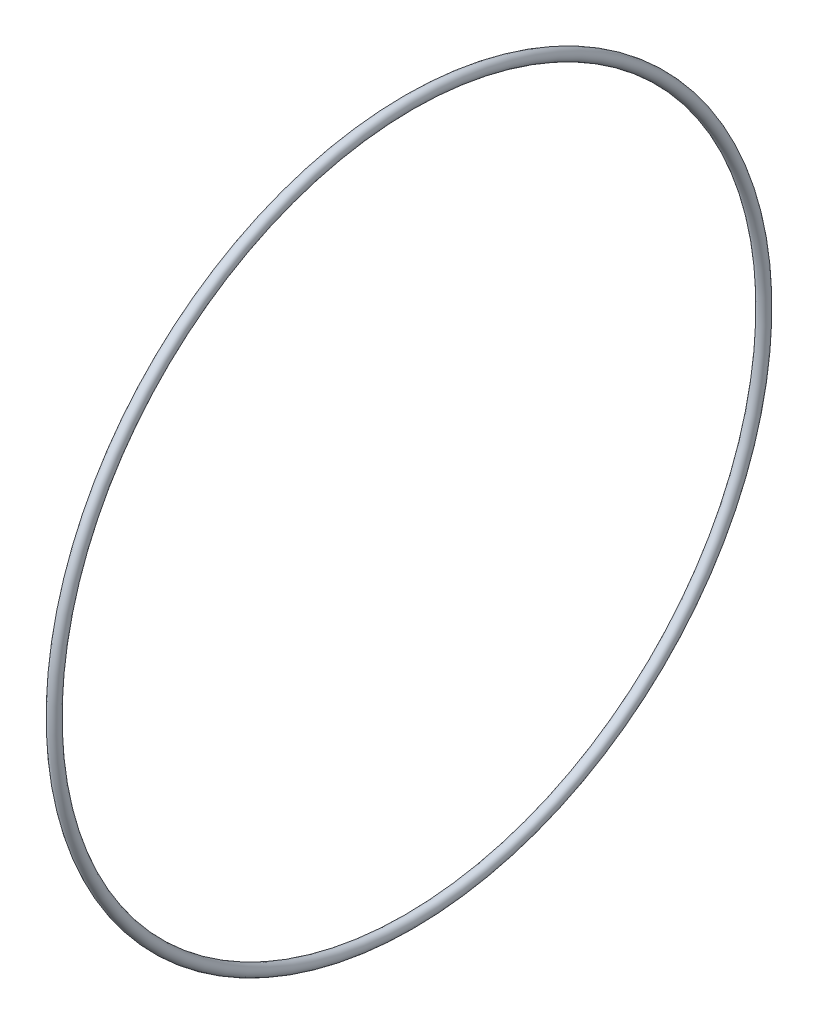
ISO-10303-21;
HEADER;
FILE_DESCRIPTION(('STEP AP214'),'2;1');
FILE_NAME('part.step','',(''),(''),'','','');
FILE_SCHEMA(('AUTOMOTIVE_DESIGN { 1 0 10303 214 1 1 1 1 }'));
ENDSEC;
DATA;
#1=APPLICATION_CONTEXT('core data for automotive mechanical design processes');
#2=APPLICATION_PROTOCOL_DEFINITION('international standard','automotive_design',2000,#1);
#3=PRODUCT_CONTEXT('',#1,'mechanical');
#4=PRODUCT('Part','Part','',(#3));
#5=PRODUCT_RELATED_PRODUCT_CATEGORY('part','',(#4));
#6=PRODUCT_DEFINITION_FORMATION('','',#4);
#7=PRODUCT_DEFINITION_CONTEXT('part definition',#1,'design');
#8=PRODUCT_DEFINITION('design','',#6,#7);
#9=PRODUCT_DEFINITION_SHAPE('','',#8);
#10=(LENGTH_UNIT() NAMED_UNIT(*) SI_UNIT(.MILLI.,.METRE.));
#11=(NAMED_UNIT(*) PLANE_ANGLE_UNIT() SI_UNIT($,.RADIAN.));
#12=(NAMED_UNIT(*) SI_UNIT($,.STERADIAN.) SOLID_ANGLE_UNIT());
#13=UNCERTAINTY_MEASURE_WITH_UNIT(LENGTH_MEASURE(1.E-05),#10,'distance_accuracy_value','');
#14=(GEOMETRIC_REPRESENTATION_CONTEXT(3) GLOBAL_UNCERTAINTY_ASSIGNED_CONTEXT((#13)) GLOBAL_UNIT_ASSIGNED_CONTEXT((#10,
#11,#12)) REPRESENTATION_CONTEXT('',''));
#15=CARTESIAN_POINT('',(0.,0.,0.));
#16=DIRECTION('',(0.,0.,1.));
#17=DIRECTION('',(1.,0.,0.));
#18=AXIS2_PLACEMENT_3D('',#15,#16,#17);
#19=CARTESIAN_POINT('',(0.,0.,0.));
#20=DIRECTION('',(-1.,0.,0.));
#21=DIRECTION('',(0.,-1.,0.));
#22=AXIS2_PLACEMENT_3D('',#19,#20,#21);
#23=TOROIDAL_SURFACE('',#22,796.0995,12.7);
#24=CARTESIAN_POINT('',(0.,-808.7995,0.));
#25=VERTEX_POINT('',#24);
#26=VERTEX_LOOP('',#25);
#27=FACE_BOUND('',#26,.T.);
#28=ADVANCED_FACE('F32',(#27),#23,.T.);
#29=CLOSED_SHELL('',(#28));
#30=CARTESIAN_POINT('',(0.,0.,0.));
#31=DIRECTION('',(-1.,0.,0.));
#32=DIRECTION('',(0.,-1.,0.));
#33=AXIS2_PLACEMENT_3D('',#30,#31,#32);
#34=TOROIDAL_SURFACE('',#33,796.0995,10.31875);
#35=CARTESIAN_POINT('',(0.,-806.41825,0.));
#36=VERTEX_POINT('',#35);
#37=VERTEX_LOOP('',#36);
#38=FACE_BOUND('',#37,.T.);
#39=ADVANCED_FACE('F45',(#38),#34,.F.);
#40=CLOSED_SHELL('',(#39));
#41=ORIENTED_CLOSED_SHELL('',*,#40,.T.);
#42=BREP_WITH_VOIDS('B2',#29,(#41));
#43=ADVANCED_BREP_SHAPE_REPRESENTATION('',(#18,#42),#14);
#44=SHAPE_DEFINITION_REPRESENTATION(#9,#43);
ENDSEC;
END-ISO-10303-21;
